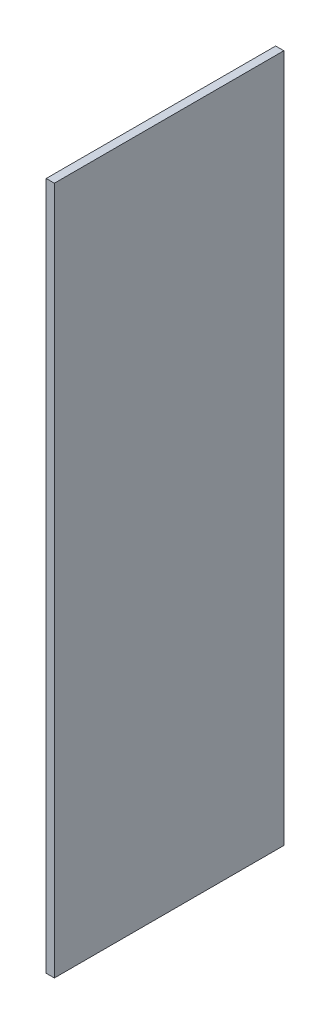
ISO-10303-21;
HEADER;
FILE_DESCRIPTION(('STEP AP214'),'2;1');
FILE_NAME('part.step','',(''),(''),'','','');
FILE_SCHEMA(('AUTOMOTIVE_DESIGN { 1 0 10303 214 1 1 1 1 }'));
ENDSEC;
DATA;
#1=APPLICATION_CONTEXT('core data for automotive mechanical design processes');
#2=APPLICATION_PROTOCOL_DEFINITION('international standard','automotive_design',2000,#1);
#3=PRODUCT_CONTEXT('',#1,'mechanical');
#4=PRODUCT('Part','Part','',(#3));
#5=PRODUCT_RELATED_PRODUCT_CATEGORY('part','',(#4));
#6=PRODUCT_DEFINITION_FORMATION('','',#4);
#7=PRODUCT_DEFINITION_CONTEXT('part definition',#1,'design');
#8=PRODUCT_DEFINITION('design','',#6,#7);
#9=PRODUCT_DEFINITION_SHAPE('','',#8);
#10=(LENGTH_UNIT() NAMED_UNIT(*) SI_UNIT(.MILLI.,.METRE.));
#11=(NAMED_UNIT(*) PLANE_ANGLE_UNIT() SI_UNIT($,.RADIAN.));
#12=(NAMED_UNIT(*) SI_UNIT($,.STERADIAN.) SOLID_ANGLE_UNIT());
#13=UNCERTAINTY_MEASURE_WITH_UNIT(LENGTH_MEASURE(1.E-05),#10,'distance_accuracy_value','');
#14=(GEOMETRIC_REPRESENTATION_CONTEXT(3) GLOBAL_UNCERTAINTY_ASSIGNED_CONTEXT((#13)) GLOBAL_UNIT_ASSIGNED_CONTEXT((#10,
#11,#12)) REPRESENTATION_CONTEXT('',''));
#15=CARTESIAN_POINT('',(0.,0.,0.));
#16=DIRECTION('',(0.,0.,1.));
#17=DIRECTION('',(1.,0.,0.));
#18=AXIS2_PLACEMENT_3D('',#15,#16,#17);
#19=CARTESIAN_POINT('',(3.175,0.,0.));
#20=DIRECTION('',(0.,0.,-1.));
#21=DIRECTION('',(0.,1.,0.));
#22=AXIS2_PLACEMENT_3D('',#19,#20,#21);
#23=PLANE('',#22);
#24=DIRECTION('',(0.,-1.,0.));
#25=VECTOR('',#24,1.);
#26=CARTESIAN_POINT('',(0.,0.,0.));
#27=LINE('',#26,#25);
#28=CARTESIAN_POINT('',(0.,266.7,0.));
#29=VERTEX_POINT('',#28);
#30=CARTESIAN_POINT('',(0.,0.,0.));
#31=VERTEX_POINT('',#30);
#32=EDGE_CURVE('E97',#29,#31,#27,.T.);
#33=ORIENTED_EDGE('',*,*,#32,.T.);
#34=DIRECTION('',(-1.,0.,0.));
#35=VECTOR('',#34,1.);
#36=CARTESIAN_POINT('',(3.175,0.,0.));
#37=LINE('',#36,#35);
#38=CARTESIAN_POINT('',(3.175,0.,0.));
#39=VERTEX_POINT('',#38);
#40=EDGE_CURVE('E11',#39,#31,#37,.T.);
#41=ORIENTED_EDGE('',*,*,#40,.F.);
#42=DIRECTION('',(0.,-1.,0.));
#43=VECTOR('',#42,1.);
#44=CARTESIAN_POINT('',(3.175,0.,0.));
#45=LINE('',#44,#43);
#46=CARTESIAN_POINT('',(3.175,266.7,0.));
#47=VERTEX_POINT('',#46);
#48=EDGE_CURVE('E85',#47,#39,#45,.T.);
#49=ORIENTED_EDGE('',*,*,#48,.F.);
#50=DIRECTION('',(-1.,0.,0.));
#51=VECTOR('',#50,1.);
#52=CARTESIAN_POINT('',(3.175,266.7,0.));
#53=LINE('',#52,#51);
#54=EDGE_CURVE('E93',#47,#29,#53,.T.);
#55=ORIENTED_EDGE('',*,*,#54,.T.);
#56=EDGE_LOOP('',(#33,#41,#49,#55));
#57=FACE_BOUND('',#56,.T.);
#58=ADVANCED_FACE('F34',(#57),#23,.F.);
#59=CARTESIAN_POINT('',(3.175,0.,0.));
#60=DIRECTION('',(0.,1.,0.));
#61=DIRECTION('',(0.,0.,1.));
#62=AXIS2_PLACEMENT_3D('',#59,#60,#61);
#63=PLANE('',#62);
#64=DIRECTION('',(0.,0.,-1.));
#65=VECTOR('',#64,1.);
#66=CARTESIAN_POINT('',(0.,0.,0.));
#67=LINE('',#66,#65);
#68=CARTESIAN_POINT('',(0.,0.,-88.9));
#69=VERTEX_POINT('',#68);
#70=EDGE_CURVE('E89',#31,#69,#67,.T.);
#71=ORIENTED_EDGE('',*,*,#70,.T.);
#72=DIRECTION('',(-1.,0.,0.));
#73=VECTOR('',#72,1.);
#74=CARTESIAN_POINT('',(3.175,0.,-88.9));
#75=LINE('',#74,#73);
#76=CARTESIAN_POINT('',(3.175,0.,-88.9));
#77=VERTEX_POINT('',#76);
#78=EDGE_CURVE('E42',#77,#69,#75,.T.);
#79=ORIENTED_EDGE('',*,*,#78,.F.);
#80=DIRECTION('',(0.,0.,-1.));
#81=VECTOR('',#80,1.);
#82=CARTESIAN_POINT('',(3.175,0.,0.));
#83=LINE('',#82,#81);
#84=EDGE_CURVE('E80',#39,#77,#83,.T.);
#85=ORIENTED_EDGE('',*,*,#84,.F.);
#86=ORIENTED_EDGE('',*,*,#40,.T.);
#87=EDGE_LOOP('',(#71,#79,#85,#86));
#88=FACE_BOUND('',#87,.T.);
#89=ADVANCED_FACE('F88',(#88),#63,.F.);
#90=CARTESIAN_POINT('',(3.175,0.,-88.9));
#91=DIRECTION('',(0.,0.,1.));
#92=DIRECTION('',(0.,-1.,0.));
#93=AXIS2_PLACEMENT_3D('',#90,#91,#92);
#94=PLANE('',#93);
#95=DIRECTION('',(0.,1.,0.));
#96=VECTOR('',#95,1.);
#97=CARTESIAN_POINT('',(0.,0.,-88.9));
#98=LINE('',#97,#96);
#99=CARTESIAN_POINT('',(0.,266.7,-88.8999999999999));
#100=VERTEX_POINT('',#99);
#101=EDGE_CURVE('E67',#69,#100,#98,.T.);
#102=ORIENTED_EDGE('',*,*,#101,.T.);
#103=DIRECTION('',(-1.,0.,0.));
#104=VECTOR('',#103,1.);
#105=CARTESIAN_POINT('',(3.175,266.7,-88.8999999999999));
#106=LINE('',#105,#104);
#107=CARTESIAN_POINT('',(3.175,266.7,-88.8999999999999));
#108=VERTEX_POINT('',#107);
#109=EDGE_CURVE('E90',#108,#100,#106,.T.);
#110=ORIENTED_EDGE('',*,*,#109,.F.);
#111=DIRECTION('',(0.,1.,0.));
#112=VECTOR('',#111,1.);
#113=CARTESIAN_POINT('',(3.175,0.,-88.9));
#114=LINE('',#113,#112);
#115=EDGE_CURVE('E83',#77,#108,#114,.T.);
#116=ORIENTED_EDGE('',*,*,#115,.F.);
#117=ORIENTED_EDGE('',*,*,#78,.T.);
#118=EDGE_LOOP('',(#102,#110,#116,#117));
#119=FACE_BOUND('',#118,.T.);
#120=ADVANCED_FACE('F91',(#119),#94,.F.);
#121=CARTESIAN_POINT('',(3.175,266.7,0.));
#122=DIRECTION('',(0.,-1.,0.));
#123=DIRECTION('',(0.,0.,-1.));
#124=AXIS2_PLACEMENT_3D('',#121,#122,#123);
#125=PLANE('',#124);
#126=DIRECTION('',(0.,0.,1.));
#127=VECTOR('',#126,1.);
#128=CARTESIAN_POINT('',(0.,266.7,0.));
#129=LINE('',#128,#127);
#130=EDGE_CURVE('E73',#100,#29,#129,.T.);
#131=ORIENTED_EDGE('',*,*,#130,.T.);
#132=ORIENTED_EDGE('',*,*,#54,.F.);
#133=DIRECTION('',(0.,0.,1.));
#134=VECTOR('',#133,1.);
#135=CARTESIAN_POINT('',(3.175,266.7,0.));
#136=LINE('',#135,#134);
#137=EDGE_CURVE('E50',#108,#47,#136,.T.);
#138=ORIENTED_EDGE('',*,*,#137,.F.);
#139=ORIENTED_EDGE('',*,*,#109,.T.);
#140=EDGE_LOOP('',(#131,#132,#138,#139));
#141=FACE_BOUND('',#140,.T.);
#142=ADVANCED_FACE('F104',(#141),#125,.F.);
#143=CARTESIAN_POINT('',(3.175,0.,0.));
#144=DIRECTION('',(-1.,0.,0.));
#145=DIRECTION('',(0.,0.,1.));
#146=AXIS2_PLACEMENT_3D('',#143,#144,#145);
#147=PLANE('',#146);
#148=ORIENTED_EDGE('',*,*,#48,.T.);
#149=ORIENTED_EDGE('',*,*,#84,.T.);
#150=ORIENTED_EDGE('',*,*,#115,.T.);
#151=ORIENTED_EDGE('',*,*,#137,.T.);
#152=EDGE_LOOP('',(#148,#149,#150,#151));
#153=FACE_BOUND('',#152,.T.);
#154=ADVANCED_FACE('F81',(#153),#147,.F.);
#155=CARTESIAN_POINT('',(0.,0.,0.));
#156=DIRECTION('',(-1.,0.,0.));
#157=DIRECTION('',(0.,0.,1.));
#158=AXIS2_PLACEMENT_3D('',#155,#156,#157);
#159=PLANE('',#158);
#160=ORIENTED_EDGE('',*,*,#32,.F.);
#161=ORIENTED_EDGE('',*,*,#130,.F.);
#162=ORIENTED_EDGE('',*,*,#101,.F.);
#163=ORIENTED_EDGE('',*,*,#70,.F.);
#164=EDGE_LOOP('',(#160,#161,#162,#163));
#165=FACE_BOUND('',#164,.T.);
#166=ADVANCED_FACE('F107',(#165),#159,.T.);
#167=CLOSED_SHELL('',(#58,#89,#120,#142,#154,#166));
#168=MANIFOLD_SOLID_BREP('B2',#167);
#169=ADVANCED_BREP_SHAPE_REPRESENTATION('',(#18,#168),#14);
#170=SHAPE_DEFINITION_REPRESENTATION(#9,#169);
ENDSEC;
END-ISO-10303-21;
